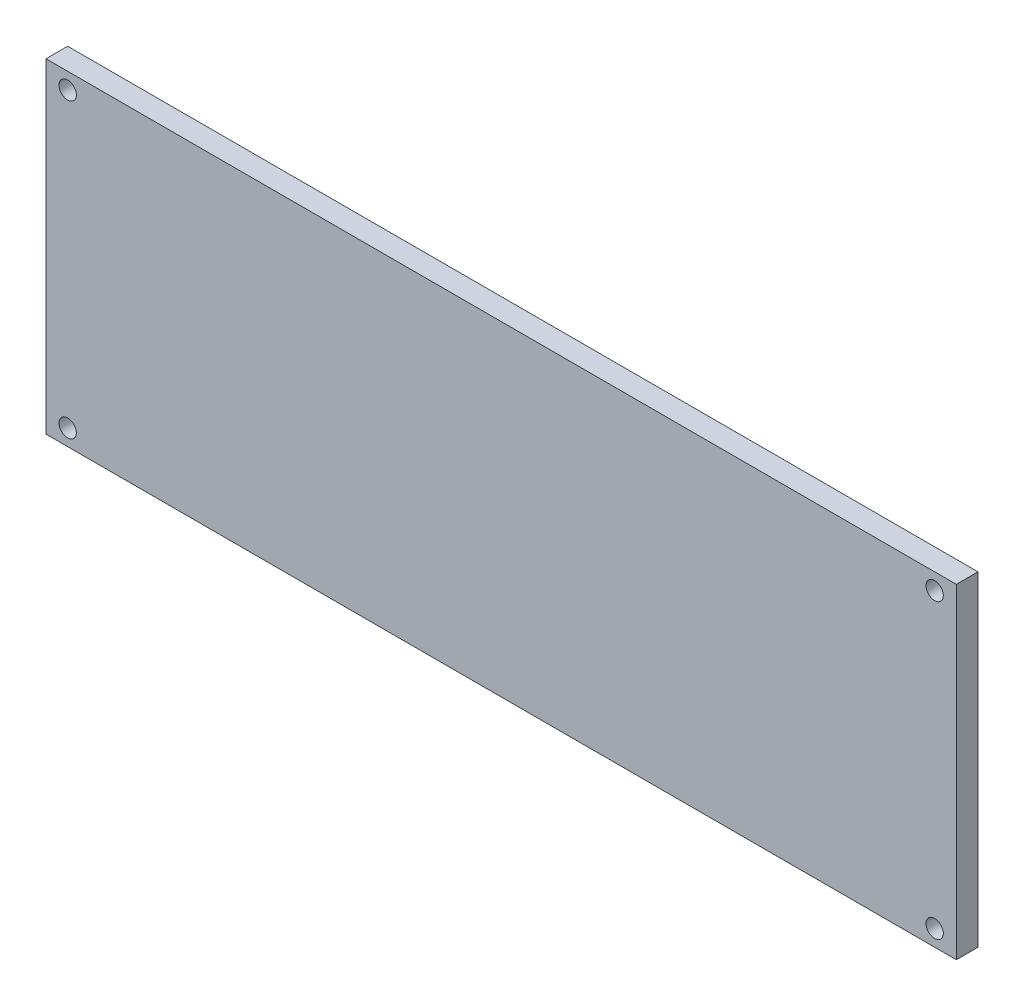
ISO-10303-21;
HEADER;
FILE_DESCRIPTION(('STEP AP214'),'2;1');
FILE_NAME('part.step','',(''),(''),'','','');
FILE_SCHEMA(('AUTOMOTIVE_DESIGN { 1 0 10303 214 1 1 1 1 }'));
ENDSEC;
DATA;
#1=APPLICATION_CONTEXT('core data for automotive mechanical design processes');
#2=APPLICATION_PROTOCOL_DEFINITION('international standard','automotive_design',2000,#1);
#3=PRODUCT_CONTEXT('',#1,'mechanical');
#4=PRODUCT('Part','Part','',(#3));
#5=PRODUCT_RELATED_PRODUCT_CATEGORY('part','',(#4));
#6=PRODUCT_DEFINITION_FORMATION('','',#4);
#7=PRODUCT_DEFINITION_CONTEXT('part definition',#1,'design');
#8=PRODUCT_DEFINITION('design','',#6,#7);
#9=PRODUCT_DEFINITION_SHAPE('','',#8);
#10=(LENGTH_UNIT() NAMED_UNIT(*) SI_UNIT(.MILLI.,.METRE.));
#11=(NAMED_UNIT(*) PLANE_ANGLE_UNIT() SI_UNIT($,.RADIAN.));
#12=(NAMED_UNIT(*) SI_UNIT($,.STERADIAN.) SOLID_ANGLE_UNIT());
#13=UNCERTAINTY_MEASURE_WITH_UNIT(LENGTH_MEASURE(1.E-05),#10,'distance_accuracy_value','');
#14=(GEOMETRIC_REPRESENTATION_CONTEXT(3) GLOBAL_UNCERTAINTY_ASSIGNED_CONTEXT((#13)) GLOBAL_UNIT_ASSIGNED_CONTEXT((#10,
#11,#12)) REPRESENTATION_CONTEXT('',''));
#15=CARTESIAN_POINT('',(0.,0.,0.));
#16=DIRECTION('',(0.,0.,1.));
#17=DIRECTION('',(1.,0.,0.));
#18=AXIS2_PLACEMENT_3D('',#15,#16,#17);
#19=CARTESIAN_POINT('',(0.,0.,5.));
#20=DIRECTION('',(0.,0.,-1.));
#21=DIRECTION('',(-1.,0.,0.));
#22=AXIS2_PLACEMENT_3D('',#19,#20,#21);
#23=PLANE('',#22);
#24=CARTESIAN_POINT('',(5.,3.74999999999999,5.));
#25=DIRECTION('',(0.,0.,-1.));
#26=DIRECTION('',(-1.,0.,0.));
#27=AXIS2_PLACEMENT_3D('',#24,#25,#26);
#28=CIRCLE('',#27,2.);
#29=CARTESIAN_POINT('',(3.00000000000001,3.74999999999999,5.));
#30=VERTEX_POINT('',#29);
#31=EDGE_CURVE('E154',#30,#30,#28,.T.);
#32=ORIENTED_EDGE('',*,*,#31,.T.);
#33=EDGE_LOOP('',(#32));
#34=FACE_BOUND('',#33,.T.);
#35=CARTESIAN_POINT('',(205.,3.75,5.));
#36=DIRECTION('',(0.,0.,1.));
#37=DIRECTION('',(1.,0.,0.));
#38=AXIS2_PLACEMENT_3D('',#35,#36,#37);
#39=CIRCLE('',#38,2.);
#40=CARTESIAN_POINT('',(207.,3.75,5.));
#41=VERTEX_POINT('',#40);
#42=EDGE_CURVE('E112',#41,#41,#39,.T.);
#43=ORIENTED_EDGE('',*,*,#42,.F.);
#44=EDGE_LOOP('',(#43));
#45=FACE_BOUND('',#44,.T.);
#46=DIRECTION('',(0.,-1.,0.));
#47=VECTOR('',#46,1.);
#48=CARTESIAN_POINT('',(0.,0.,5.));
#49=LINE('',#48,#47);
#50=CARTESIAN_POINT('',(0.,75.,5.));
#51=VERTEX_POINT('',#50);
#52=CARTESIAN_POINT('',(0.,0.,5.));
#53=VERTEX_POINT('',#52);
#54=EDGE_CURVE('E92',#51,#53,#49,.T.);
#55=ORIENTED_EDGE('',*,*,#54,.T.);
#56=DIRECTION('',(1.,0.,0.));
#57=VECTOR('',#56,1.);
#58=CARTESIAN_POINT('',(0.,0.,5.));
#59=LINE('',#58,#57);
#60=CARTESIAN_POINT('',(210.,0.,5.));
#61=VERTEX_POINT('',#60);
#62=EDGE_CURVE('E87',#53,#61,#59,.T.);
#63=ORIENTED_EDGE('',*,*,#62,.T.);
#64=DIRECTION('',(0.,1.,0.));
#65=VECTOR('',#64,1.);
#66=CARTESIAN_POINT('',(210.,0.,5.));
#67=LINE('',#66,#65);
#68=CARTESIAN_POINT('',(210.,75.,5.));
#69=VERTEX_POINT('',#68);
#70=EDGE_CURVE('E90',#61,#69,#67,.T.);
#71=ORIENTED_EDGE('',*,*,#70,.T.);
#72=DIRECTION('',(-1.,0.,0.));
#73=VECTOR('',#72,1.);
#74=CARTESIAN_POINT('',(0.,75.,5.));
#75=LINE('',#74,#73);
#76=EDGE_CURVE('E57',#69,#51,#75,.T.);
#77=ORIENTED_EDGE('',*,*,#76,.T.);
#78=EDGE_LOOP('',(#55,#63,#71,#77));
#79=FACE_BOUND('',#78,.T.);
#80=CARTESIAN_POINT('',(4.99999999999998,71.25,5.));
#81=DIRECTION('',(0.,0.,1.));
#82=DIRECTION('',(1.,0.,0.));
#83=AXIS2_PLACEMENT_3D('',#80,#81,#82);
#84=CIRCLE('',#83,2.);
#85=CARTESIAN_POINT('',(6.99999999999998,71.25,5.));
#86=VERTEX_POINT('',#85);
#87=EDGE_CURVE('E146',#86,#86,#84,.T.);
#88=ORIENTED_EDGE('',*,*,#87,.F.);
#89=EDGE_LOOP('',(#88));
#90=FACE_BOUND('',#89,.T.);
#91=CARTESIAN_POINT('',(205.,71.25,5.));
#92=DIRECTION('',(0.,0.,-1.));
#93=DIRECTION('',(-1.,0.,0.));
#94=AXIS2_PLACEMENT_3D('',#91,#92,#93);
#95=CIRCLE('',#94,2.);
#96=CARTESIAN_POINT('',(203.,71.25,5.));
#97=VERTEX_POINT('',#96);
#98=EDGE_CURVE('E138',#97,#97,#95,.T.);
#99=ORIENTED_EDGE('',*,*,#98,.T.);
#100=EDGE_LOOP('',(#99));
#101=FACE_BOUND('',#100,.T.);
#102=ADVANCED_FACE('F39',(#34,#45,#79,#90,#101),#23,.F.);
#103=CARTESIAN_POINT('',(0.,0.,0.));
#104=DIRECTION('',(0.,0.,-1.));
#105=DIRECTION('',(-1.,0.,0.));
#106=AXIS2_PLACEMENT_3D('',#103,#104,#105);
#107=PLANE('',#106);
#108=CARTESIAN_POINT('',(4.99999999999998,71.25,0.));
#109=DIRECTION('',(0.,0.,1.));
#110=DIRECTION('',(1.,0.,0.));
#111=AXIS2_PLACEMENT_3D('',#108,#109,#110);
#112=CIRCLE('',#111,2.);
#113=CARTESIAN_POINT('',(6.99999999999998,71.25,0.));
#114=VERTEX_POINT('',#113);
#115=EDGE_CURVE('E150',#114,#114,#112,.T.);
#116=ORIENTED_EDGE('',*,*,#115,.T.);
#117=EDGE_LOOP('',(#116));
#118=FACE_BOUND('',#117,.T.);
#119=CARTESIAN_POINT('',(205.,3.75,0.));
#120=DIRECTION('',(0.,0.,1.));
#121=DIRECTION('',(1.,0.,0.));
#122=AXIS2_PLACEMENT_3D('',#119,#120,#121);
#123=CIRCLE('',#122,2.);
#124=CARTESIAN_POINT('',(207.,3.75,0.));
#125=VERTEX_POINT('',#124);
#126=EDGE_CURVE('E130',#125,#125,#123,.T.);
#127=ORIENTED_EDGE('',*,*,#126,.T.);
#128=EDGE_LOOP('',(#127));
#129=FACE_BOUND('',#128,.T.);
#130=DIRECTION('',(0.,-1.,0.));
#131=VECTOR('',#130,1.);
#132=CARTESIAN_POINT('',(0.,0.,0.));
#133=LINE('',#132,#131);
#134=CARTESIAN_POINT('',(0.,75.,0.));
#135=VERTEX_POINT('',#134);
#136=CARTESIAN_POINT('',(0.,0.,0.));
#137=VERTEX_POINT('',#136);
#138=EDGE_CURVE('E108',#135,#137,#133,.T.);
#139=ORIENTED_EDGE('',*,*,#138,.F.);
#140=DIRECTION('',(-1.,0.,0.));
#141=VECTOR('',#140,1.);
#142=CARTESIAN_POINT('',(0.,75.,0.));
#143=LINE('',#142,#141);
#144=CARTESIAN_POINT('',(210.,75.,0.));
#145=VERTEX_POINT('',#144);
#146=EDGE_CURVE('E80',#145,#135,#143,.T.);
#147=ORIENTED_EDGE('',*,*,#146,.F.);
#148=DIRECTION('',(0.,1.,0.));
#149=VECTOR('',#148,1.);
#150=CARTESIAN_POINT('',(210.,0.,0.));
#151=LINE('',#150,#149);
#152=CARTESIAN_POINT('',(210.,0.,0.));
#153=VERTEX_POINT('',#152);
#154=EDGE_CURVE('E74',#153,#145,#151,.T.);
#155=ORIENTED_EDGE('',*,*,#154,.F.);
#156=DIRECTION('',(1.,0.,0.));
#157=VECTOR('',#156,1.);
#158=CARTESIAN_POINT('',(0.,0.,0.));
#159=LINE('',#158,#157);
#160=EDGE_CURVE('E97',#137,#153,#159,.T.);
#161=ORIENTED_EDGE('',*,*,#160,.F.);
#162=EDGE_LOOP('',(#139,#147,#155,#161));
#163=FACE_BOUND('',#162,.T.);
#164=CARTESIAN_POINT('',(5.,3.74999999999999,0.));
#165=DIRECTION('',(0.,0.,-1.));
#166=DIRECTION('',(-1.,0.,0.));
#167=AXIS2_PLACEMENT_3D('',#164,#165,#166);
#168=CIRCLE('',#167,2.);
#169=CARTESIAN_POINT('',(3.00000000000001,3.74999999999999,0.));
#170=VERTEX_POINT('',#169);
#171=EDGE_CURVE('E134',#170,#170,#168,.T.);
#172=ORIENTED_EDGE('',*,*,#171,.F.);
#173=EDGE_LOOP('',(#172));
#174=FACE_BOUND('',#173,.T.);
#175=CARTESIAN_POINT('',(205.,71.25,0.));
#176=DIRECTION('',(0.,0.,-1.));
#177=DIRECTION('',(-1.,0.,0.));
#178=AXIS2_PLACEMENT_3D('',#175,#176,#177);
#179=CIRCLE('',#178,2.);
#180=CARTESIAN_POINT('',(203.,71.25,0.));
#181=VERTEX_POINT('',#180);
#182=EDGE_CURVE('E142',#181,#181,#179,.T.);
#183=ORIENTED_EDGE('',*,*,#182,.F.);
#184=EDGE_LOOP('',(#183));
#185=FACE_BOUND('',#184,.T.);
#186=ADVANCED_FACE('F125',(#118,#129,#163,#174,#185),#107,.T.);
#187=CARTESIAN_POINT('',(0.,0.,5.));
#188=DIRECTION('',(1.,0.,0.));
#189=DIRECTION('',(0.,0.,-1.));
#190=AXIS2_PLACEMENT_3D('',#187,#188,#189);
#191=PLANE('',#190);
#192=ORIENTED_EDGE('',*,*,#138,.T.);
#193=DIRECTION('',(0.,0.,-1.));
#194=VECTOR('',#193,1.);
#195=CARTESIAN_POINT('',(0.,0.,5.));
#196=LINE('',#195,#194);
#197=EDGE_CURVE('E11',#53,#137,#196,.T.);
#198=ORIENTED_EDGE('',*,*,#197,.F.);
#199=ORIENTED_EDGE('',*,*,#54,.F.);
#200=DIRECTION('',(0.,0.,-1.));
#201=VECTOR('',#200,1.);
#202=CARTESIAN_POINT('',(0.,75.,5.));
#203=LINE('',#202,#201);
#204=EDGE_CURVE('E104',#51,#135,#203,.T.);
#205=ORIENTED_EDGE('',*,*,#204,.T.);
#206=EDGE_LOOP('',(#192,#198,#199,#205));
#207=FACE_BOUND('',#206,.T.);
#208=ADVANCED_FACE('F41',(#207),#191,.F.);
#209=CARTESIAN_POINT('',(0.,0.,5.));
#210=DIRECTION('',(0.,1.,0.));
#211=DIRECTION('',(0.,0.,1.));
#212=AXIS2_PLACEMENT_3D('',#209,#210,#211);
#213=PLANE('',#212);
#214=ORIENTED_EDGE('',*,*,#160,.T.);
#215=DIRECTION('',(0.,0.,-1.));
#216=VECTOR('',#215,1.);
#217=CARTESIAN_POINT('',(210.,0.,5.));
#218=LINE('',#217,#216);
#219=EDGE_CURVE('E49',#61,#153,#218,.T.);
#220=ORIENTED_EDGE('',*,*,#219,.F.);
#221=ORIENTED_EDGE('',*,*,#62,.F.);
#222=ORIENTED_EDGE('',*,*,#197,.T.);
#223=EDGE_LOOP('',(#214,#220,#221,#222));
#224=FACE_BOUND('',#223,.T.);
#225=ADVANCED_FACE('F96',(#224),#213,.F.);
#226=CARTESIAN_POINT('',(210.,0.,5.));
#227=DIRECTION('',(-1.,0.,0.));
#228=DIRECTION('',(0.,-1.,0.));
#229=AXIS2_PLACEMENT_3D('',#226,#227,#228);
#230=PLANE('',#229);
#231=ORIENTED_EDGE('',*,*,#154,.T.);
#232=DIRECTION('',(0.,0.,-1.));
#233=VECTOR('',#232,1.);
#234=CARTESIAN_POINT('',(210.,75.,5.));
#235=LINE('',#234,#233);
#236=EDGE_CURVE('E99',#69,#145,#235,.T.);
#237=ORIENTED_EDGE('',*,*,#236,.F.);
#238=ORIENTED_EDGE('',*,*,#70,.F.);
#239=ORIENTED_EDGE('',*,*,#219,.T.);
#240=EDGE_LOOP('',(#231,#237,#238,#239));
#241=FACE_BOUND('',#240,.T.);
#242=ADVANCED_FACE('F100',(#241),#230,.F.);
#243=CARTESIAN_POINT('',(0.,75.,5.));
#244=DIRECTION('',(0.,-1.,0.));
#245=DIRECTION('',(0.,0.,-1.));
#246=AXIS2_PLACEMENT_3D('',#243,#244,#245);
#247=PLANE('',#246);
#248=ORIENTED_EDGE('',*,*,#146,.T.);
#249=ORIENTED_EDGE('',*,*,#204,.F.);
#250=ORIENTED_EDGE('',*,*,#76,.F.);
#251=ORIENTED_EDGE('',*,*,#236,.T.);
#252=EDGE_LOOP('',(#248,#249,#250,#251));
#253=FACE_BOUND('',#252,.T.);
#254=ADVANCED_FACE('F122',(#253),#247,.F.);
#255=CARTESIAN_POINT('',(205.,3.75,5.));
#256=DIRECTION('',(0.,0.,-1.));
#257=DIRECTION('',(-1.,0.,0.));
#258=AXIS2_PLACEMENT_3D('',#255,#256,#257);
#259=CYLINDRICAL_SURFACE('',#258,2.);
#260=ORIENTED_EDGE('',*,*,#42,.T.);
#261=EDGE_LOOP('',(#260));
#262=FACE_BOUND('',#261,.T.);
#263=ORIENTED_EDGE('',*,*,#126,.F.);
#264=EDGE_LOOP('',(#263));
#265=FACE_BOUND('',#264,.T.);
#266=ADVANCED_FACE('F187',(#262,#265),#259,.F.);
#267=CARTESIAN_POINT('',(5.,3.74999999999999,5.));
#268=DIRECTION('',(0.,0.,-1.));
#269=DIRECTION('',(-1.,0.,0.));
#270=AXIS2_PLACEMENT_3D('',#267,#268,#269);
#271=CYLINDRICAL_SURFACE('',#270,2.);
#272=ORIENTED_EDGE('',*,*,#31,.F.);
#273=EDGE_LOOP('',(#272));
#274=FACE_BOUND('',#273,.T.);
#275=ORIENTED_EDGE('',*,*,#171,.T.);
#276=EDGE_LOOP('',(#275));
#277=FACE_BOUND('',#276,.T.);
#278=ADVANCED_FACE('F162',(#274,#277),#271,.F.);
#279=CARTESIAN_POINT('',(4.99999999999998,71.25,5.));
#280=DIRECTION('',(0.,0.,-1.));
#281=DIRECTION('',(-1.,0.,0.));
#282=AXIS2_PLACEMENT_3D('',#279,#280,#281);
#283=CYLINDRICAL_SURFACE('',#282,2.);
#284=ORIENTED_EDGE('',*,*,#87,.T.);
#285=EDGE_LOOP('',(#284));
#286=FACE_BOUND('',#285,.T.);
#287=ORIENTED_EDGE('',*,*,#115,.F.);
#288=EDGE_LOOP('',(#287));
#289=FACE_BOUND('',#288,.T.);
#290=ADVANCED_FACE('F171',(#286,#289),#283,.F.);
#291=CARTESIAN_POINT('',(205.,71.25,5.));
#292=DIRECTION('',(0.,0.,-1.));
#293=DIRECTION('',(-1.,0.,0.));
#294=AXIS2_PLACEMENT_3D('',#291,#292,#293);
#295=CYLINDRICAL_SURFACE('',#294,2.);
#296=ORIENTED_EDGE('',*,*,#98,.F.);
#297=EDGE_LOOP('',(#296));
#298=FACE_BOUND('',#297,.T.);
#299=ORIENTED_EDGE('',*,*,#182,.T.);
#300=EDGE_LOOP('',(#299));
#301=FACE_BOUND('',#300,.T.);
#302=ADVANCED_FACE('F169',(#298,#301),#295,.F.);
#303=CLOSED_SHELL('',(#102,#186,#208,#225,#242,#254,#266,#278,#290,#302));
#304=MANIFOLD_SOLID_BREP('B2',#303);
#305=ADVANCED_BREP_SHAPE_REPRESENTATION('',(#18,#304),#14);
#306=SHAPE_DEFINITION_REPRESENTATION(#9,#305);
ENDSEC;
END-ISO-10303-21;
